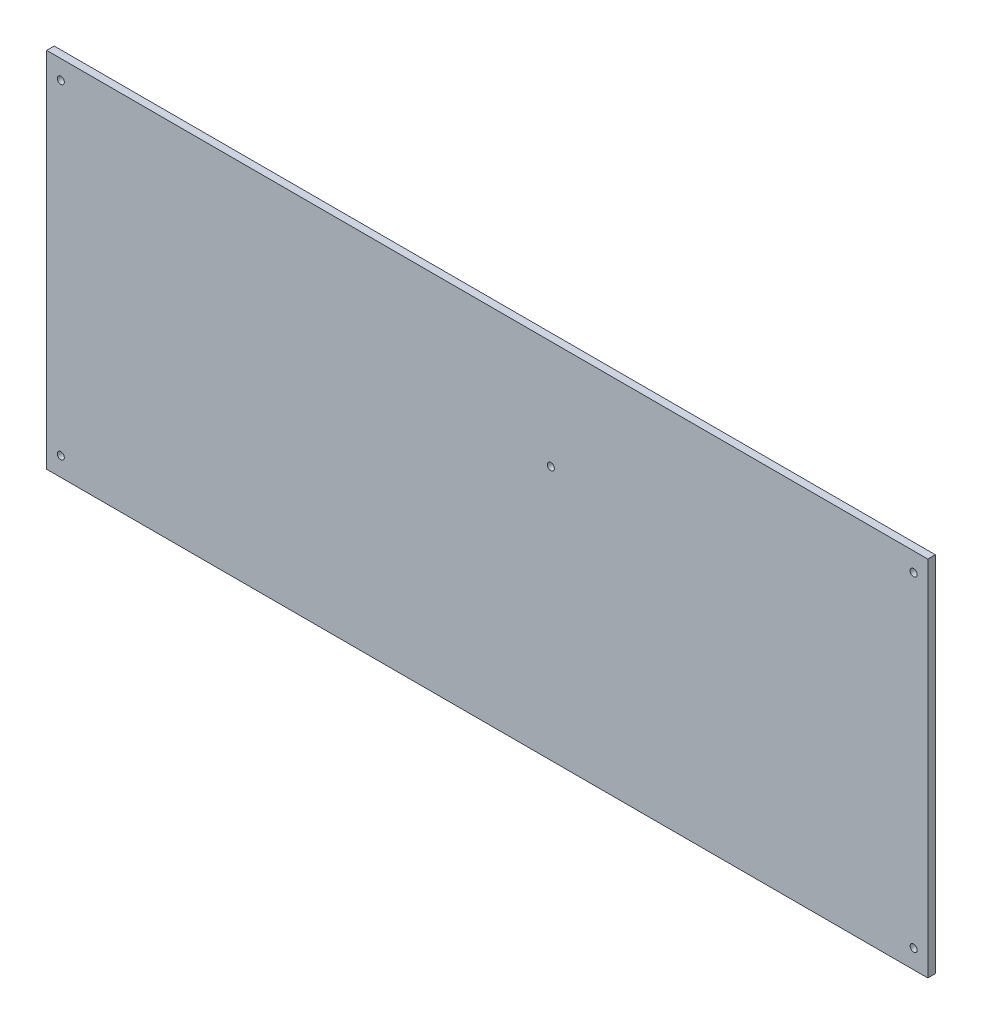
ISO-10303-21;
HEADER;
FILE_DESCRIPTION(('STEP AP214'),'2;1');
FILE_NAME('part.step','',(''),(''),'','','');
FILE_SCHEMA(('AUTOMOTIVE_DESIGN { 1 0 10303 214 1 1 1 1 }'));
ENDSEC;
DATA;
#1=APPLICATION_CONTEXT('core data for automotive mechanical design processes');
#2=APPLICATION_PROTOCOL_DEFINITION('international standard','automotive_design',2000,#1);
#3=PRODUCT_CONTEXT('',#1,'mechanical');
#4=PRODUCT('Part','Part','',(#3));
#5=PRODUCT_RELATED_PRODUCT_CATEGORY('part','',(#4));
#6=PRODUCT_DEFINITION_FORMATION('','',#4);
#7=PRODUCT_DEFINITION_CONTEXT('part definition',#1,'design');
#8=PRODUCT_DEFINITION('design','',#6,#7);
#9=PRODUCT_DEFINITION_SHAPE('','',#8);
#10=(LENGTH_UNIT() NAMED_UNIT(*) SI_UNIT(.MILLI.,.METRE.));
#11=(NAMED_UNIT(*) PLANE_ANGLE_UNIT() SI_UNIT($,.RADIAN.));
#12=(NAMED_UNIT(*) SI_UNIT($,.STERADIAN.) SOLID_ANGLE_UNIT());
#13=UNCERTAINTY_MEASURE_WITH_UNIT(LENGTH_MEASURE(1.E-05),#10,'distance_accuracy_value','');
#14=(GEOMETRIC_REPRESENTATION_CONTEXT(3) GLOBAL_UNCERTAINTY_ASSIGNED_CONTEXT((#13)) GLOBAL_UNIT_ASSIGNED_CONTEXT((#10,
#11,#12)) REPRESENTATION_CONTEXT('',''));
#15=CARTESIAN_POINT('',(0.,0.,0.));
#16=DIRECTION('',(0.,0.,1.));
#17=DIRECTION('',(1.,0.,0.));
#18=AXIS2_PLACEMENT_3D('',#15,#16,#17);
#19=CARTESIAN_POINT('',(0.,-77.0000009400001,-1.6));
#20=DIRECTION('',(0.,-1.,0.));
#21=DIRECTION('',(0.,0.,-1.));
#22=AXIS2_PLACEMENT_3D('',#19,#20,#21);
#23=PLANE('',#22);
#24=DIRECTION('',(1.,0.,0.));
#25=VECTOR('',#24,1.);
#26=CARTESIAN_POINT('',(0.,-77.0000009400001,0.));
#27=LINE('',#26,#25);
#28=CARTESIAN_POINT('',(0.,-77.0000009400001,0.));
#29=VERTEX_POINT('',#28);
#30=CARTESIAN_POINT('',(186.99999938,-77.0000009400001,0.));
#31=VERTEX_POINT('',#30);
#32=EDGE_CURVE('E99',#29,#31,#27,.T.);
#33=ORIENTED_EDGE('',*,*,#32,.F.);
#34=DIRECTION('',(0.,0.,1.));
#35=VECTOR('',#34,1.);
#36=CARTESIAN_POINT('',(0.,-77.0000009400001,-1.6));
#37=LINE('',#36,#35);
#38=CARTESIAN_POINT('',(0.,-77.0000009400001,-1.6));
#39=VERTEX_POINT('',#38);
#40=EDGE_CURVE('E11',#39,#29,#37,.T.);
#41=ORIENTED_EDGE('',*,*,#40,.F.);
#42=DIRECTION('',(1.,0.,0.));
#43=VECTOR('',#42,1.);
#44=CARTESIAN_POINT('',(0.,-77.0000009400001,-1.6));
#45=LINE('',#44,#43);
#46=CARTESIAN_POINT('',(186.99999938,-77.0000009400001,-1.6));
#47=VERTEX_POINT('',#46);
#48=EDGE_CURVE('E92',#39,#47,#45,.T.);
#49=ORIENTED_EDGE('',*,*,#48,.T.);
#50=DIRECTION('',(0.,0.,1.));
#51=VECTOR('',#50,1.);
#52=CARTESIAN_POINT('',(186.99999938,-77.0000009400001,-1.6));
#53=LINE('',#52,#51);
#54=EDGE_CURVE('E37',#47,#31,#53,.T.);
#55=ORIENTED_EDGE('',*,*,#54,.T.);
#56=EDGE_LOOP('',(#33,#41,#49,#55));
#57=FACE_BOUND('',#56,.T.);
#58=ADVANCED_FACE('F34',(#57),#23,.T.);
#59=CARTESIAN_POINT('',(0.,-77.0000009400001,-1.6));
#60=DIRECTION('',(-1.,0.,0.));
#61=DIRECTION('',(0.,0.,1.));
#62=AXIS2_PLACEMENT_3D('',#59,#60,#61);
#63=PLANE('',#62);
#64=DIRECTION('',(0.,-1.,0.));
#65=VECTOR('',#64,1.);
#66=CARTESIAN_POINT('',(0.,-77.0000009400001,0.));
#67=LINE('',#66,#65);
#68=CARTESIAN_POINT('',(0.,0.,0.));
#69=VERTEX_POINT('',#68);
#70=EDGE_CURVE('E94',#69,#29,#67,.T.);
#71=ORIENTED_EDGE('',*,*,#70,.F.);
#72=DIRECTION('',(0.,0.,1.));
#73=VECTOR('',#72,1.);
#74=CARTESIAN_POINT('',(0.,0.,-1.6));
#75=LINE('',#74,#73);
#76=CARTESIAN_POINT('',(0.,0.,-1.6));
#77=VERTEX_POINT('',#76);
#78=EDGE_CURVE('E43',#77,#69,#75,.T.);
#79=ORIENTED_EDGE('',*,*,#78,.F.);
#80=DIRECTION('',(0.,-1.,0.));
#81=VECTOR('',#80,1.);
#82=CARTESIAN_POINT('',(0.,-77.0000009400001,-1.6));
#83=LINE('',#82,#81);
#84=EDGE_CURVE('E89',#77,#39,#83,.T.);
#85=ORIENTED_EDGE('',*,*,#84,.T.);
#86=ORIENTED_EDGE('',*,*,#40,.T.);
#87=EDGE_LOOP('',(#71,#79,#85,#86));
#88=FACE_BOUND('',#87,.T.);
#89=ADVANCED_FACE('F110',(#88),#63,.T.);
#90=CARTESIAN_POINT('',(0.,0.,-1.6));
#91=DIRECTION('',(0.,1.,0.));
#92=DIRECTION('',(0.,0.,1.));
#93=AXIS2_PLACEMENT_3D('',#90,#91,#92);
#94=PLANE('',#93);
#95=DIRECTION('',(-1.,0.,0.));
#96=VECTOR('',#95,1.);
#97=CARTESIAN_POINT('',(0.,0.,0.));
#98=LINE('',#97,#96);
#99=CARTESIAN_POINT('',(186.99999938,0.,0.));
#100=VERTEX_POINT('',#99);
#101=EDGE_CURVE('E84',#100,#69,#98,.T.);
#102=ORIENTED_EDGE('',*,*,#101,.F.);
#103=DIRECTION('',(0.,0.,1.));
#104=VECTOR('',#103,1.);
#105=CARTESIAN_POINT('',(186.99999938,0.,-1.6));
#106=LINE('',#105,#104);
#107=CARTESIAN_POINT('',(186.99999938,0.,-1.6));
#108=VERTEX_POINT('',#107);
#109=EDGE_CURVE('E79',#108,#100,#106,.T.);
#110=ORIENTED_EDGE('',*,*,#109,.F.);
#111=DIRECTION('',(-1.,0.,0.));
#112=VECTOR('',#111,1.);
#113=CARTESIAN_POINT('',(0.,0.,-1.6));
#114=LINE('',#113,#112);
#115=EDGE_CURVE('E82',#108,#77,#114,.T.);
#116=ORIENTED_EDGE('',*,*,#115,.T.);
#117=ORIENTED_EDGE('',*,*,#78,.T.);
#118=EDGE_LOOP('',(#102,#110,#116,#117));
#119=FACE_BOUND('',#118,.T.);
#120=ADVANCED_FACE('F81',(#119),#94,.T.);
#121=CARTESIAN_POINT('',(186.99999938,-77.0000009400001,-1.6));
#122=DIRECTION('',(1.,0.,0.));
#123=DIRECTION('',(0.,0.,-1.));
#124=AXIS2_PLACEMENT_3D('',#121,#122,#123);
#125=PLANE('',#124);
#126=DIRECTION('',(0.,1.,0.));
#127=VECTOR('',#126,1.);
#128=CARTESIAN_POINT('',(186.99999938,-77.0000009400001,0.));
#129=LINE('',#128,#127);
#130=EDGE_CURVE('E102',#31,#100,#129,.T.);
#131=ORIENTED_EDGE('',*,*,#130,.F.);
#132=ORIENTED_EDGE('',*,*,#54,.F.);
#133=DIRECTION('',(0.,1.,0.));
#134=VECTOR('',#133,1.);
#135=CARTESIAN_POINT('',(186.99999938,-77.0000009400001,-1.6));
#136=LINE('',#135,#134);
#137=EDGE_CURVE('E88',#47,#108,#136,.T.);
#138=ORIENTED_EDGE('',*,*,#137,.T.);
#139=ORIENTED_EDGE('',*,*,#109,.T.);
#140=EDGE_LOOP('',(#131,#132,#138,#139));
#141=FACE_BOUND('',#140,.T.);
#142=ADVANCED_FACE('F91',(#141),#125,.T.);
#143=CARTESIAN_POINT('',(0.,0.,-1.6));
#144=DIRECTION('',(0.,0.,1.));
#145=DIRECTION('',(1.,0.,0.));
#146=AXIS2_PLACEMENT_3D('',#143,#144,#145);
#147=PLANE('',#146);
#148=CARTESIAN_POINT('',(184.0000003,-73.00000132,-1.6));
#149=DIRECTION('',(0.,0.,1.));
#150=DIRECTION('',(1.,0.,0.));
#151=AXIS2_PLACEMENT_3D('',#148,#149,#150);
#152=CIRCLE('',#151,0.749998499999988);
#153=CARTESIAN_POINT('',(184.7499988,-73.00000132,-1.6));
#154=VERTEX_POINT('',#153);
#155=EDGE_CURVE('E171',#154,#154,#152,.T.);
#156=ORIENTED_EDGE('',*,*,#155,.T.);
#157=EDGE_LOOP('',(#156));
#158=FACE_BOUND('',#157,.T.);
#159=CARTESIAN_POINT('',(3.00000162,-3.99999962,-1.6));
#160=DIRECTION('',(0.,0.,1.));
#161=DIRECTION('',(1.,0.,0.));
#162=AXIS2_PLACEMENT_3D('',#159,#160,#161);
#163=CIRCLE('',#162,0.7499985);
#164=CARTESIAN_POINT('',(3.75000012,-3.99999962,-1.6));
#165=VERTEX_POINT('',#164);
#166=EDGE_CURVE('E177',#165,#165,#163,.T.);
#167=ORIENTED_EDGE('',*,*,#166,.T.);
#168=EDGE_LOOP('',(#167));
#169=FACE_BOUND('',#168,.T.);
#170=CARTESIAN_POINT('',(3.00000162,-73.00000132,-1.6));
#171=DIRECTION('',(0.,0.,1.));
#172=DIRECTION('',(1.,0.,0.));
#173=AXIS2_PLACEMENT_3D('',#170,#171,#172);
#174=CIRCLE('',#173,0.7499985);
#175=CARTESIAN_POINT('',(3.75000012,-73.00000132,-1.6));
#176=VERTEX_POINT('',#175);
#177=EDGE_CURVE('E156',#176,#176,#174,.T.);
#178=ORIENTED_EDGE('',*,*,#177,.T.);
#179=EDGE_LOOP('',(#178));
#180=FACE_BOUND('',#179,.T.);
#181=CARTESIAN_POINT('',(106.99999936,-22.99999972,-1.6));
#182=DIRECTION('',(0.,0.,1.));
#183=DIRECTION('',(1.,0.,0.));
#184=AXIS2_PLACEMENT_3D('',#181,#182,#183);
#185=CIRCLE('',#184,0.749998500000001);
#186=CARTESIAN_POINT('',(107.74999786,-22.99999972,-1.6));
#187=VERTEX_POINT('',#186);
#188=EDGE_CURVE('E161',#187,#187,#185,.T.);
#189=ORIENTED_EDGE('',*,*,#188,.T.);
#190=EDGE_LOOP('',(#189));
#191=FACE_BOUND('',#190,.T.);
#192=CARTESIAN_POINT('',(184.0000003,-3.99999962,-1.6));
#193=DIRECTION('',(0.,0.,1.));
#194=DIRECTION('',(1.,0.,0.));
#195=AXIS2_PLACEMENT_3D('',#192,#193,#194);
#196=CIRCLE('',#195,0.749998499999988);
#197=CARTESIAN_POINT('',(184.7499988,-3.99999962,-1.6));
#198=VERTEX_POINT('',#197);
#199=EDGE_CURVE('E103',#198,#198,#196,.T.);
#200=ORIENTED_EDGE('',*,*,#199,.T.);
#201=EDGE_LOOP('',(#200));
#202=FACE_BOUND('',#201,.T.);
#203=ORIENTED_EDGE('',*,*,#48,.F.);
#204=ORIENTED_EDGE('',*,*,#84,.F.);
#205=ORIENTED_EDGE('',*,*,#115,.F.);
#206=ORIENTED_EDGE('',*,*,#137,.F.);
#207=EDGE_LOOP('',(#203,#204,#205,#206));
#208=FACE_BOUND('',#207,.T.);
#209=ADVANCED_FACE('F87',(#158,#169,#180,#191,#202,#208),#147,.F.);
#210=CARTESIAN_POINT('',(0.,0.,0.));
#211=DIRECTION('',(0.,0.,1.));
#212=DIRECTION('',(1.,0.,0.));
#213=AXIS2_PLACEMENT_3D('',#210,#211,#212);
#214=PLANE('',#213);
#215=CARTESIAN_POINT('',(184.0000003,-73.00000132,0.));
#216=DIRECTION('',(0.,0.,1.));
#217=DIRECTION('',(1.,0.,0.));
#218=AXIS2_PLACEMENT_3D('',#215,#216,#217);
#219=CIRCLE('',#218,0.749998499999988);
#220=CARTESIAN_POINT('',(184.7499988,-73.00000132,0.));
#221=VERTEX_POINT('',#220);
#222=EDGE_CURVE('E174',#221,#221,#219,.T.);
#223=ORIENTED_EDGE('',*,*,#222,.F.);
#224=EDGE_LOOP('',(#223));
#225=FACE_BOUND('',#224,.T.);
#226=CARTESIAN_POINT('',(3.00000162,-3.99999962,0.));
#227=DIRECTION('',(0.,0.,1.));
#228=DIRECTION('',(1.,0.,0.));
#229=AXIS2_PLACEMENT_3D('',#226,#227,#228);
#230=CIRCLE('',#229,0.7499985);
#231=CARTESIAN_POINT('',(3.75000012,-3.99999962,0.));
#232=VERTEX_POINT('',#231);
#233=EDGE_CURVE('E163',#232,#232,#230,.T.);
#234=ORIENTED_EDGE('',*,*,#233,.F.);
#235=EDGE_LOOP('',(#234));
#236=FACE_BOUND('',#235,.T.);
#237=CARTESIAN_POINT('',(3.00000162,-73.00000132,0.));
#238=DIRECTION('',(0.,0.,1.));
#239=DIRECTION('',(1.,0.,0.));
#240=AXIS2_PLACEMENT_3D('',#237,#238,#239);
#241=CIRCLE('',#240,0.7499985);
#242=CARTESIAN_POINT('',(3.75000012,-73.00000132,0.));
#243=VERTEX_POINT('',#242);
#244=EDGE_CURVE('E159',#243,#243,#241,.T.);
#245=ORIENTED_EDGE('',*,*,#244,.F.);
#246=EDGE_LOOP('',(#245));
#247=FACE_BOUND('',#246,.T.);
#248=CARTESIAN_POINT('',(106.99999936,-22.99999972,0.));
#249=DIRECTION('',(0.,0.,1.));
#250=DIRECTION('',(1.,0.,0.));
#251=AXIS2_PLACEMENT_3D('',#248,#249,#250);
#252=CIRCLE('',#251,0.749998500000001);
#253=CARTESIAN_POINT('',(107.74999786,-22.99999972,0.));
#254=VERTEX_POINT('',#253);
#255=EDGE_CURVE('E166',#254,#254,#252,.T.);
#256=ORIENTED_EDGE('',*,*,#255,.F.);
#257=EDGE_LOOP('',(#256));
#258=FACE_BOUND('',#257,.T.);
#259=CARTESIAN_POINT('',(184.0000003,-3.99999962,0.));
#260=DIRECTION('',(0.,0.,1.));
#261=DIRECTION('',(1.,0.,0.));
#262=AXIS2_PLACEMENT_3D('',#259,#260,#261);
#263=CIRCLE('',#262,0.749998499999988);
#264=CARTESIAN_POINT('',(184.7499988,-3.99999962,0.));
#265=VERTEX_POINT('',#264);
#266=EDGE_CURVE('E173',#265,#265,#263,.T.);
#267=ORIENTED_EDGE('',*,*,#266,.F.);
#268=EDGE_LOOP('',(#267));
#269=FACE_BOUND('',#268,.T.);
#270=ORIENTED_EDGE('',*,*,#32,.T.);
#271=ORIENTED_EDGE('',*,*,#130,.T.);
#272=ORIENTED_EDGE('',*,*,#101,.T.);
#273=ORIENTED_EDGE('',*,*,#70,.T.);
#274=EDGE_LOOP('',(#270,#271,#272,#273));
#275=FACE_BOUND('',#274,.T.);
#276=ADVANCED_FACE('F109',(#225,#236,#247,#258,#269,#275),#214,.T.);
#277=CARTESIAN_POINT('',(184.0000003,-3.99999962,-1.6));
#278=DIRECTION('',(0.,0.,1.));
#279=DIRECTION('',(1.,0.,0.));
#280=AXIS2_PLACEMENT_3D('',#277,#278,#279);
#281=CYLINDRICAL_SURFACE('',#280,0.749998499999988);
#282=ORIENTED_EDGE('',*,*,#199,.F.);
#283=EDGE_LOOP('',(#282));
#284=FACE_BOUND('',#283,.T.);
#285=ORIENTED_EDGE('',*,*,#266,.T.);
#286=EDGE_LOOP('',(#285));
#287=FACE_BOUND('',#286,.T.);
#288=ADVANCED_FACE('F128',(#284,#287),#281,.F.);
#289=CARTESIAN_POINT('',(106.99999936,-22.99999972,-1.6));
#290=DIRECTION('',(0.,0.,1.));
#291=DIRECTION('',(1.,0.,0.));
#292=AXIS2_PLACEMENT_3D('',#289,#290,#291);
#293=CYLINDRICAL_SURFACE('',#292,0.749998500000001);
#294=ORIENTED_EDGE('',*,*,#188,.F.);
#295=EDGE_LOOP('',(#294));
#296=FACE_BOUND('',#295,.T.);
#297=ORIENTED_EDGE('',*,*,#255,.T.);
#298=EDGE_LOOP('',(#297));
#299=FACE_BOUND('',#298,.T.);
#300=ADVANCED_FACE('F135',(#296,#299),#293,.F.);
#301=CARTESIAN_POINT('',(3.00000162,-73.00000132,-1.6));
#302=DIRECTION('',(0.,0.,1.));
#303=DIRECTION('',(1.,0.,0.));
#304=AXIS2_PLACEMENT_3D('',#301,#302,#303);
#305=CYLINDRICAL_SURFACE('',#304,0.7499985);
#306=ORIENTED_EDGE('',*,*,#177,.F.);
#307=EDGE_LOOP('',(#306));
#308=FACE_BOUND('',#307,.T.);
#309=ORIENTED_EDGE('',*,*,#244,.T.);
#310=EDGE_LOOP('',(#309));
#311=FACE_BOUND('',#310,.T.);
#312=ADVANCED_FACE('F141',(#308,#311),#305,.F.);
#313=CARTESIAN_POINT('',(3.00000162,-3.99999962,-1.6));
#314=DIRECTION('',(0.,0.,1.));
#315=DIRECTION('',(1.,0.,0.));
#316=AXIS2_PLACEMENT_3D('',#313,#314,#315);
#317=CYLINDRICAL_SURFACE('',#316,0.7499985);
#318=ORIENTED_EDGE('',*,*,#166,.F.);
#319=EDGE_LOOP('',(#318));
#320=FACE_BOUND('',#319,.T.);
#321=ORIENTED_EDGE('',*,*,#233,.T.);
#322=EDGE_LOOP('',(#321));
#323=FACE_BOUND('',#322,.T.);
#324=ADVANCED_FACE('F137',(#320,#323),#317,.F.);
#325=CARTESIAN_POINT('',(184.0000003,-73.00000132,-1.6));
#326=DIRECTION('',(0.,0.,1.));
#327=DIRECTION('',(1.,0.,0.));
#328=AXIS2_PLACEMENT_3D('',#325,#326,#327);
#329=CYLINDRICAL_SURFACE('',#328,0.749998499999988);
#330=ORIENTED_EDGE('',*,*,#155,.F.);
#331=EDGE_LOOP('',(#330));
#332=FACE_BOUND('',#331,.T.);
#333=ORIENTED_EDGE('',*,*,#222,.T.);
#334=EDGE_LOOP('',(#333));
#335=FACE_BOUND('',#334,.T.);
#336=ADVANCED_FACE('F140',(#332,#335),#329,.F.);
#337=CLOSED_SHELL('',(#58,#89,#120,#142,#209,#276,#288,#300,#312,#324,#336));
#338=MANIFOLD_SOLID_BREP('B2',#337);
#339=ADVANCED_BREP_SHAPE_REPRESENTATION('',(#18,#338),#14);
#340=SHAPE_DEFINITION_REPRESENTATION(#9,#339);
ENDSEC;
END-ISO-10303-21;
